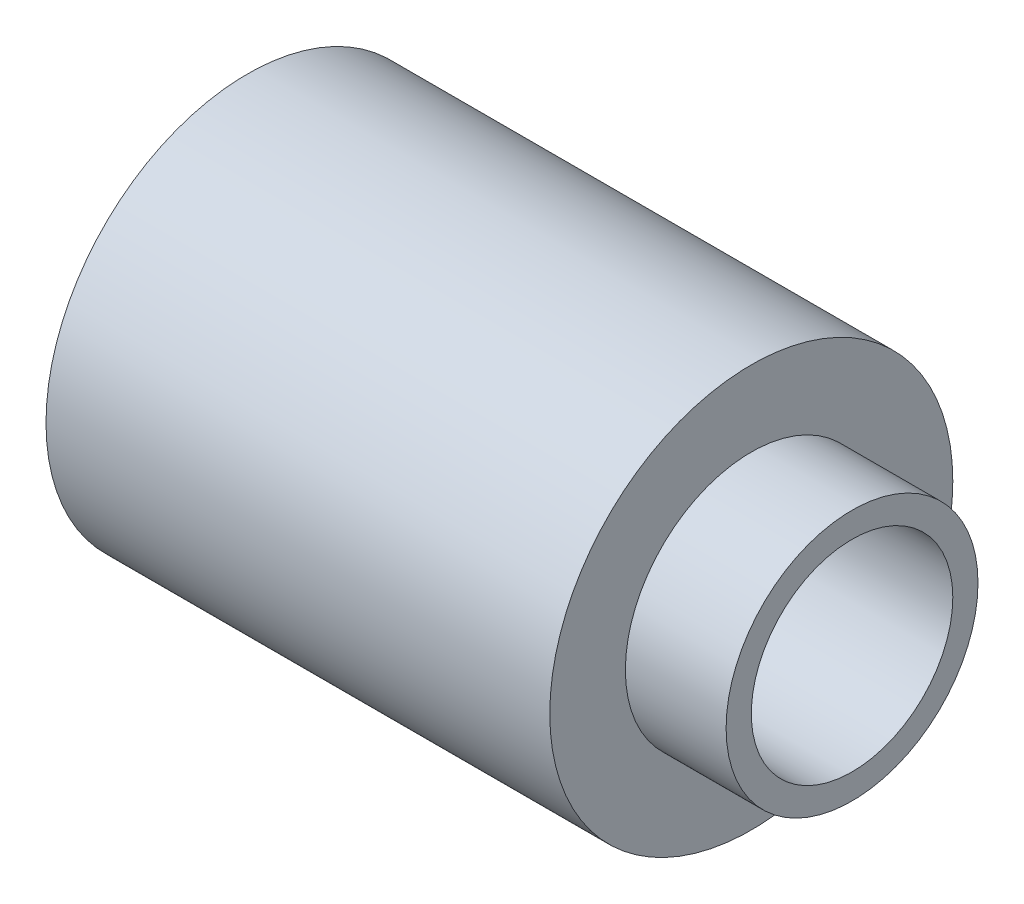
ISO-10303-21;
HEADER;
FILE_DESCRIPTION(('STEP AP214'),'2;1');
FILE_NAME('part.step','',(''),(''),'','','');
FILE_SCHEMA(('AUTOMOTIVE_DESIGN { 1 0 10303 214 1 1 1 1 }'));
ENDSEC;
DATA;
#1=APPLICATION_CONTEXT('core data for automotive mechanical design processes');
#2=APPLICATION_PROTOCOL_DEFINITION('international standard','automotive_design',2000,#1);
#3=PRODUCT_CONTEXT('',#1,'mechanical');
#4=PRODUCT('Part','Part','',(#3));
#5=PRODUCT_RELATED_PRODUCT_CATEGORY('part','',(#4));
#6=PRODUCT_DEFINITION_FORMATION('','',#4);
#7=PRODUCT_DEFINITION_CONTEXT('part definition',#1,'design');
#8=PRODUCT_DEFINITION('design','',#6,#7);
#9=PRODUCT_DEFINITION_SHAPE('','',#8);
#10=(LENGTH_UNIT() NAMED_UNIT(*) SI_UNIT(.MILLI.,.METRE.));
#11=(NAMED_UNIT(*) PLANE_ANGLE_UNIT() SI_UNIT($,.RADIAN.));
#12=(NAMED_UNIT(*) SI_UNIT($,.STERADIAN.) SOLID_ANGLE_UNIT());
#13=UNCERTAINTY_MEASURE_WITH_UNIT(LENGTH_MEASURE(1.E-05),#10,'distance_accuracy_value','');
#14=(GEOMETRIC_REPRESENTATION_CONTEXT(3) GLOBAL_UNCERTAINTY_ASSIGNED_CONTEXT((#13)) GLOBAL_UNIT_ASSIGNED_CONTEXT((#10,
#11,#12)) REPRESENTATION_CONTEXT('',''));
#15=CARTESIAN_POINT('',(0.,0.,0.));
#16=DIRECTION('',(0.,0.,1.));
#17=DIRECTION('',(1.,0.,0.));
#18=AXIS2_PLACEMENT_3D('',#15,#16,#17);
#19=CARTESIAN_POINT('',(10.,0.,0.));
#20=DIRECTION('',(1.,0.,0.));
#21=DIRECTION('',(0.,0.,-1.));
#22=AXIS2_PLACEMENT_3D('',#19,#20,#21);
#23=PLANE('',#22);
#24=CARTESIAN_POINT('',(10.,0.,0.));
#25=DIRECTION('',(1.,0.,0.));
#26=DIRECTION('',(0.,0.,-1.));
#27=AXIS2_PLACEMENT_3D('',#24,#25,#26);
#28=CIRCLE('',#27,4.);
#29=CARTESIAN_POINT('',(10.,0.,-4.));
#30=VERTEX_POINT('',#29);
#31=EDGE_CURVE('E10',#30,#30,#28,.T.);
#32=ORIENTED_EDGE('',*,*,#31,.T.);
#33=EDGE_LOOP('',(#32));
#34=FACE_BOUND('',#33,.T.);
#35=CARTESIAN_POINT('',(10.,0.,0.));
#36=DIRECTION('',(1.,0.,0.));
#37=DIRECTION('',(0.,0.,-1.));
#38=AXIS2_PLACEMENT_3D('',#35,#36,#37);
#39=CIRCLE('',#38,2.5);
#40=CARTESIAN_POINT('',(10.,0.,-2.5));
#41=VERTEX_POINT('',#40);
#42=EDGE_CURVE('E48',#41,#41,#39,.T.);
#43=ORIENTED_EDGE('',*,*,#42,.F.);
#44=EDGE_LOOP('',(#43));
#45=FACE_BOUND('',#44,.T.);
#46=ADVANCED_FACE('F32',(#34,#45),#23,.T.);
#47=CARTESIAN_POINT('',(0.,0.,0.));
#48=DIRECTION('',(1.,0.,0.));
#49=DIRECTION('',(0.,0.,-1.));
#50=AXIS2_PLACEMENT_3D('',#47,#48,#49);
#51=PLANE('',#50);
#52=CARTESIAN_POINT('',(0.,0.,0.));
#53=DIRECTION('',(1.,0.,0.));
#54=DIRECTION('',(0.,0.,-1.));
#55=AXIS2_PLACEMENT_3D('',#52,#53,#54);
#56=CIRCLE('',#55,4.);
#57=CARTESIAN_POINT('',(0.,0.,-4.));
#58=VERTEX_POINT('',#57);
#59=EDGE_CURVE('E36',#58,#58,#56,.T.);
#60=ORIENTED_EDGE('',*,*,#59,.F.);
#61=EDGE_LOOP('',(#60));
#62=FACE_BOUND('',#61,.T.);
#63=CARTESIAN_POINT('',(0.,0.,0.));
#64=DIRECTION('',(1.,0.,0.));
#65=DIRECTION('',(0.,0.,-1.));
#66=AXIS2_PLACEMENT_3D('',#63,#64,#65);
#67=CIRCLE('',#66,2.);
#68=CARTESIAN_POINT('',(0.,0.,-2.));
#69=VERTEX_POINT('',#68);
#70=EDGE_CURVE('E43',#69,#69,#67,.T.);
#71=ORIENTED_EDGE('',*,*,#70,.T.);
#72=EDGE_LOOP('',(#71));
#73=FACE_BOUND('',#72,.T.);
#74=ADVANCED_FACE('F73',(#62,#73),#51,.F.);
#75=CARTESIAN_POINT('',(10.,0.,0.));
#76=DIRECTION('',(-1.,0.,0.));
#77=DIRECTION('',(0.,0.,1.));
#78=AXIS2_PLACEMENT_3D('',#75,#76,#77);
#79=CYLINDRICAL_SURFACE('',#78,4.);
#80=ORIENTED_EDGE('',*,*,#31,.F.);
#81=EDGE_LOOP('',(#80));
#82=FACE_BOUND('',#81,.T.);
#83=ORIENTED_EDGE('',*,*,#59,.T.);
#84=EDGE_LOOP('',(#83));
#85=FACE_BOUND('',#84,.T.);
#86=ADVANCED_FACE('F34',(#82,#85),#79,.T.);
#87=CARTESIAN_POINT('',(10.,0.,0.));
#88=DIRECTION('',(-1.,0.,0.));
#89=DIRECTION('',(0.,0.,1.));
#90=AXIS2_PLACEMENT_3D('',#87,#88,#89);
#91=CYLINDRICAL_SURFACE('',#90,2.);
#92=ORIENTED_EDGE('',*,*,#70,.F.);
#93=EDGE_LOOP('',(#92));
#94=FACE_BOUND('',#93,.T.);
#95=CARTESIAN_POINT('',(12.,0.,0.));
#96=DIRECTION('',(1.,0.,0.));
#97=DIRECTION('',(0.,0.,-1.));
#98=AXIS2_PLACEMENT_3D('',#95,#96,#97);
#99=CIRCLE('',#98,2.);
#100=CARTESIAN_POINT('',(12.,0.,-2.));
#101=VERTEX_POINT('',#100);
#102=EDGE_CURVE('E51',#101,#101,#99,.T.);
#103=ORIENTED_EDGE('',*,*,#102,.T.);
#104=EDGE_LOOP('',(#103));
#105=FACE_BOUND('',#104,.T.);
#106=ADVANCED_FACE('F57',(#94,#105),#91,.F.);
#107=CARTESIAN_POINT('',(12.,0.,0.));
#108=DIRECTION('',(1.,0.,0.));
#109=DIRECTION('',(0.,0.,-1.));
#110=AXIS2_PLACEMENT_3D('',#107,#108,#109);
#111=PLANE('',#110);
#112=CARTESIAN_POINT('',(12.,0.,0.));
#113=DIRECTION('',(1.,0.,0.));
#114=DIRECTION('',(0.,0.,-1.));
#115=AXIS2_PLACEMENT_3D('',#112,#113,#114);
#116=CIRCLE('',#115,2.5);
#117=CARTESIAN_POINT('',(12.,0.,-2.5));
#118=VERTEX_POINT('',#117);
#119=EDGE_CURVE('E47',#118,#118,#116,.T.);
#120=ORIENTED_EDGE('',*,*,#119,.T.);
#121=EDGE_LOOP('',(#120));
#122=FACE_BOUND('',#121,.T.);
#123=ORIENTED_EDGE('',*,*,#102,.F.);
#124=EDGE_LOOP('',(#123));
#125=FACE_BOUND('',#124,.T.);
#126=ADVANCED_FACE('F59',(#122,#125),#111,.T.);
#127=CARTESIAN_POINT('',(12.,0.,0.));
#128=DIRECTION('',(-1.,0.,0.));
#129=DIRECTION('',(0.,0.,1.));
#130=AXIS2_PLACEMENT_3D('',#127,#128,#129);
#131=CYLINDRICAL_SURFACE('',#130,2.5);
#132=ORIENTED_EDGE('',*,*,#119,.F.);
#133=EDGE_LOOP('',(#132));
#134=FACE_BOUND('',#133,.T.);
#135=ORIENTED_EDGE('',*,*,#42,.T.);
#136=EDGE_LOOP('',(#135));
#137=FACE_BOUND('',#136,.T.);
#138=ADVANCED_FACE('F61',(#134,#137),#131,.T.);
#139=CLOSED_SHELL('',(#46,#74,#86,#106,#126,#138));
#140=MANIFOLD_SOLID_BREP('B2',#139);
#141=ADVANCED_BREP_SHAPE_REPRESENTATION('',(#18,#140),#14);
#142=SHAPE_DEFINITION_REPRESENTATION(#9,#141);
ENDSEC;
END-ISO-10303-21;
